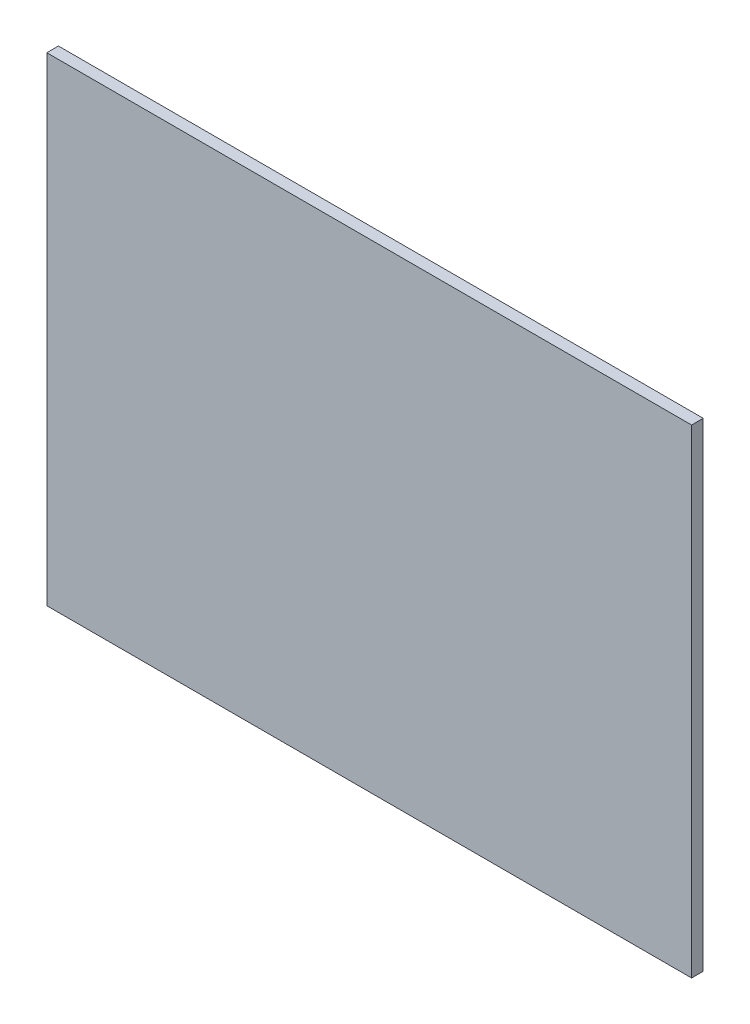
ISO-10303-21;
HEADER;
FILE_DESCRIPTION(('STEP AP214'),'2;1');
FILE_NAME('part.step','',(''),(''),'','','');
FILE_SCHEMA(('AUTOMOTIVE_DESIGN { 1 0 10303 214 1 1 1 1 }'));
ENDSEC;
DATA;
#1=APPLICATION_CONTEXT('core data for automotive mechanical design processes');
#2=APPLICATION_PROTOCOL_DEFINITION('international standard','automotive_design',2000,#1);
#3=PRODUCT_CONTEXT('',#1,'mechanical');
#4=PRODUCT('Part','Part','',(#3));
#5=PRODUCT_RELATED_PRODUCT_CATEGORY('part','',(#4));
#6=PRODUCT_DEFINITION_FORMATION('','',#4);
#7=PRODUCT_DEFINITION_CONTEXT('part definition',#1,'design');
#8=PRODUCT_DEFINITION('design','',#6,#7);
#9=PRODUCT_DEFINITION_SHAPE('','',#8);
#10=(LENGTH_UNIT() NAMED_UNIT(*) SI_UNIT(.MILLI.,.METRE.));
#11=(NAMED_UNIT(*) PLANE_ANGLE_UNIT() SI_UNIT($,.RADIAN.));
#12=(NAMED_UNIT(*) SI_UNIT($,.STERADIAN.) SOLID_ANGLE_UNIT());
#13=UNCERTAINTY_MEASURE_WITH_UNIT(LENGTH_MEASURE(1.E-05),#10,'distance_accuracy_value','');
#14=(GEOMETRIC_REPRESENTATION_CONTEXT(3) GLOBAL_UNCERTAINTY_ASSIGNED_CONTEXT((#13)) GLOBAL_UNIT_ASSIGNED_CONTEXT((#10,
#11,#12)) REPRESENTATION_CONTEXT('',''));
#15=CARTESIAN_POINT('',(0.,0.,0.));
#16=DIRECTION('',(0.,0.,1.));
#17=DIRECTION('',(1.,0.,0.));
#18=AXIS2_PLACEMENT_3D('',#15,#16,#17);
#19=CARTESIAN_POINT('',(-330.24085403582,502.44421101,-834.623441925082));
#20=DIRECTION('',(-1.,0.,0.));
#21=DIRECTION('',(0.,0.,1.));
#22=AXIS2_PLACEMENT_3D('',#19,#20,#21);
#23=PLANE('',#22);
#24=DIRECTION('',(0.,1.,0.));
#25=VECTOR('',#24,1.);
#26=CARTESIAN_POINT('',(-330.24085403582,502.44421101,-11.90625));
#27=LINE('',#26,#25);
#28=CARTESIAN_POINT('',(-330.24085403582,11.90625,-11.90625));
#29=VERTEX_POINT('',#28);
#30=CARTESIAN_POINT('',(-330.24085403582,502.44421101,-11.90625));
#31=VERTEX_POINT('',#30);
#32=EDGE_CURVE('E40',#29,#31,#27,.T.);
#33=ORIENTED_EDGE('',*,*,#32,.F.);
#34=DIRECTION('',(0.,0.,1.));
#35=VECTOR('',#34,1.);
#36=CARTESIAN_POINT('',(-330.24085403582,11.90625,-834.623441925082));
#37=LINE('',#36,#35);
#38=CARTESIAN_POINT('',(-330.24085403582,11.90625,0.));
#39=VERTEX_POINT('',#38);
#40=EDGE_CURVE('E68',#29,#39,#37,.T.);
#41=ORIENTED_EDGE('',*,*,#40,.T.);
#42=DIRECTION('',(0.,-1.,0.));
#43=VECTOR('',#42,1.);
#44=CARTESIAN_POINT('',(-330.24085403582,502.44421101,0.));
#45=LINE('',#44,#43);
#46=CARTESIAN_POINT('',(-330.24085403582,502.44421101,0.));
#47=VERTEX_POINT('',#46);
#48=EDGE_CURVE('E72',#47,#39,#45,.T.);
#49=ORIENTED_EDGE('',*,*,#48,.F.);
#50=DIRECTION('',(0.,0.,1.));
#51=VECTOR('',#50,1.);
#52=CARTESIAN_POINT('',(-330.24085403582,502.44421101,-834.623441925082));
#53=LINE('',#52,#51);
#54=EDGE_CURVE('E95',#31,#47,#53,.T.);
#55=ORIENTED_EDGE('',*,*,#54,.F.);
#56=EDGE_LOOP('',(#33,#41,#49,#55));
#57=FACE_BOUND('',#56,.T.);
#58=ADVANCED_FACE('F32',(#57),#23,.T.);
#59=CARTESIAN_POINT('',(-330.24085403582,502.44421101,-834.623441925082));
#60=DIRECTION('',(0.,1.,0.));
#61=DIRECTION('',(0.,0.,1.));
#62=AXIS2_PLACEMENT_3D('',#59,#60,#61);
#63=PLANE('',#62);
#64=DIRECTION('',(1.,0.,0.));
#65=VECTOR('',#64,1.);
#66=CARTESIAN_POINT('',(-330.24085403582,502.44421101,-11.90625));
#67=LINE('',#66,#65);
#68=CARTESIAN_POINT('',(330.24085403583,502.44421101,-11.90625));
#69=VERTEX_POINT('',#68);
#70=EDGE_CURVE('E46',#31,#69,#67,.T.);
#71=ORIENTED_EDGE('',*,*,#70,.F.);
#72=ORIENTED_EDGE('',*,*,#54,.T.);
#73=DIRECTION('',(-1.,0.,0.));
#74=VECTOR('',#73,1.);
#75=CARTESIAN_POINT('',(-330.24085403582,502.44421101,0.));
#76=LINE('',#75,#74);
#77=CARTESIAN_POINT('',(330.24085403583,502.44421101,0.));
#78=VERTEX_POINT('',#77);
#79=EDGE_CURVE('E77',#78,#47,#76,.T.);
#80=ORIENTED_EDGE('',*,*,#79,.F.);
#81=DIRECTION('',(0.,0.,1.));
#82=VECTOR('',#81,1.);
#83=CARTESIAN_POINT('',(330.24085403583,502.44421101,-834.623441925082));
#84=LINE('',#83,#82);
#85=EDGE_CURVE('E98',#69,#78,#84,.T.);
#86=ORIENTED_EDGE('',*,*,#85,.F.);
#87=EDGE_LOOP('',(#71,#72,#80,#86));
#88=FACE_BOUND('',#87,.T.);
#89=ADVANCED_FACE('F104',(#88),#63,.T.);
#90=CARTESIAN_POINT('',(330.24085403583,502.44421101,-834.623441925082));
#91=DIRECTION('',(1.,0.,0.));
#92=DIRECTION('',(0.,0.,-1.));
#93=AXIS2_PLACEMENT_3D('',#90,#91,#92);
#94=PLANE('',#93);
#95=DIRECTION('',(0.,-1.,0.));
#96=VECTOR('',#95,1.);
#97=CARTESIAN_POINT('',(330.24085403583,502.44421101,-11.90625));
#98=LINE('',#97,#96);
#99=CARTESIAN_POINT('',(330.24085403583,11.90625,-11.90625));
#100=VERTEX_POINT('',#99);
#101=EDGE_CURVE('E97',#69,#100,#98,.T.);
#102=ORIENTED_EDGE('',*,*,#101,.F.);
#103=ORIENTED_EDGE('',*,*,#85,.T.);
#104=DIRECTION('',(0.,1.,0.));
#105=VECTOR('',#104,1.);
#106=CARTESIAN_POINT('',(330.24085403583,502.44421101,0.));
#107=LINE('',#106,#105);
#108=CARTESIAN_POINT('',(330.24085403583,11.90625,0.));
#109=VERTEX_POINT('',#108);
#110=EDGE_CURVE('E85',#109,#78,#107,.T.);
#111=ORIENTED_EDGE('',*,*,#110,.F.);
#112=DIRECTION('',(0.,0.,1.));
#113=VECTOR('',#112,1.);
#114=CARTESIAN_POINT('',(330.24085403583,11.90625,-834.623441925082));
#115=LINE('',#114,#113);
#116=EDGE_CURVE('E76',#100,#109,#115,.T.);
#117=ORIENTED_EDGE('',*,*,#116,.F.);
#118=EDGE_LOOP('',(#102,#103,#111,#117));
#119=FACE_BOUND('',#118,.T.);
#120=ADVANCED_FACE('F102',(#119),#94,.T.);
#121=CARTESIAN_POINT('',(-330.24085403582,11.90625,-834.623441925082));
#122=DIRECTION('',(0.,-1.,0.));
#123=DIRECTION('',(0.,0.,-1.));
#124=AXIS2_PLACEMENT_3D('',#121,#122,#123);
#125=PLANE('',#124);
#126=DIRECTION('',(-1.,0.,0.));
#127=VECTOR('',#126,1.);
#128=CARTESIAN_POINT('',(-330.24085403582,11.90625,-11.90625));
#129=LINE('',#128,#127);
#130=EDGE_CURVE('E11',#100,#29,#129,.T.);
#131=ORIENTED_EDGE('',*,*,#130,.F.);
#132=ORIENTED_EDGE('',*,*,#116,.T.);
#133=DIRECTION('',(1.,0.,0.));
#134=VECTOR('',#133,1.);
#135=CARTESIAN_POINT('',(-330.24085403582,11.90625,0.));
#136=LINE('',#135,#134);
#137=EDGE_CURVE('E79',#39,#109,#136,.T.);
#138=ORIENTED_EDGE('',*,*,#137,.F.);
#139=ORIENTED_EDGE('',*,*,#40,.F.);
#140=EDGE_LOOP('',(#131,#132,#138,#139));
#141=FACE_BOUND('',#140,.T.);
#142=ADVANCED_FACE('F80',(#141),#125,.T.);
#143=CARTESIAN_POINT('',(0.,0.,0.));
#144=DIRECTION('',(0.,0.,1.));
#145=DIRECTION('',(1.,0.,0.));
#146=AXIS2_PLACEMENT_3D('',#143,#144,#145);
#147=PLANE('',#146);
#148=ORIENTED_EDGE('',*,*,#48,.T.);
#149=ORIENTED_EDGE('',*,*,#137,.T.);
#150=ORIENTED_EDGE('',*,*,#110,.T.);
#151=ORIENTED_EDGE('',*,*,#79,.T.);
#152=EDGE_LOOP('',(#148,#149,#150,#151));
#153=FACE_BOUND('',#152,.T.);
#154=ADVANCED_FACE('F87',(#153),#147,.T.);
#155=CARTESIAN_POINT('',(-330.24085403582,514.35046101,-11.90625));
#156=DIRECTION('',(0.,0.,1.));
#157=DIRECTION('',(1.,0.,0.));
#158=AXIS2_PLACEMENT_3D('',#155,#156,#157);
#159=PLANE('',#158);
#160=ORIENTED_EDGE('',*,*,#32,.T.);
#161=ORIENTED_EDGE('',*,*,#70,.T.);
#162=ORIENTED_EDGE('',*,*,#101,.T.);
#163=ORIENTED_EDGE('',*,*,#130,.T.);
#164=EDGE_LOOP('',(#160,#161,#162,#163));
#165=FACE_BOUND('',#164,.T.);
#166=ADVANCED_FACE('F106',(#165),#159,.F.);
#167=CLOSED_SHELL('',(#58,#89,#120,#142,#154,#166));
#168=MANIFOLD_SOLID_BREP('B2',#167);
#169=ADVANCED_BREP_SHAPE_REPRESENTATION('',(#18,#168),#14);
#170=SHAPE_DEFINITION_REPRESENTATION(#9,#169);
ENDSEC;
END-ISO-10303-21;
